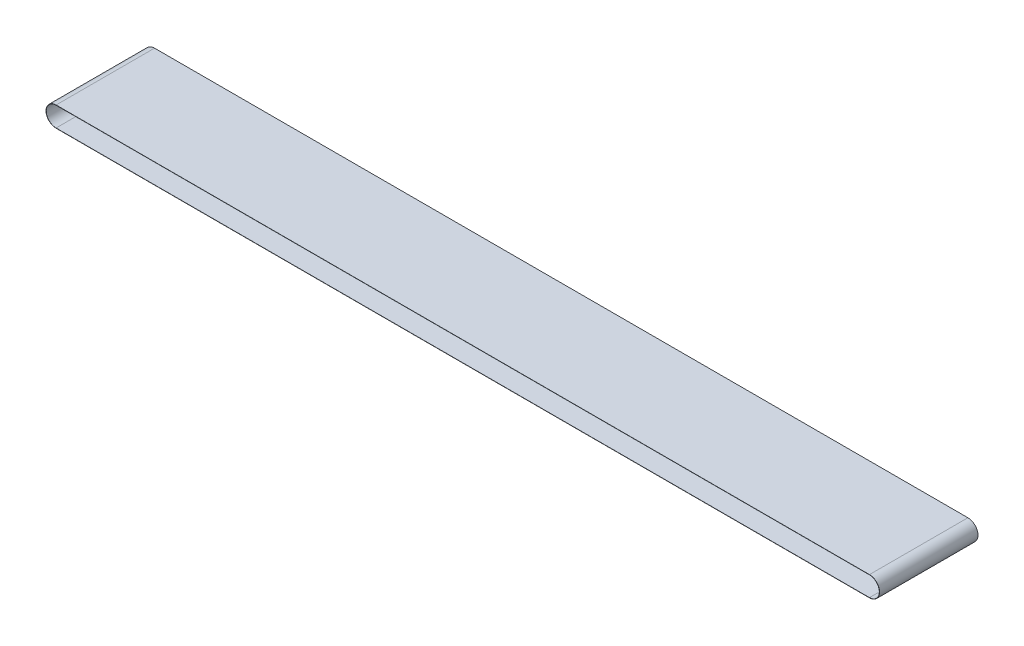
ISO-10303-21;
HEADER;
FILE_DESCRIPTION(('STEP AP214'),'2;1');
FILE_NAME('part.step','',(''),(''),'','','');
FILE_SCHEMA(('AUTOMOTIVE_DESIGN { 1 0 10303 214 1 1 1 1 }'));
ENDSEC;
DATA;
#1=APPLICATION_CONTEXT('core data for automotive mechanical design processes');
#2=APPLICATION_PROTOCOL_DEFINITION('international standard','automotive_design',2000,#1);
#3=PRODUCT_CONTEXT('',#1,'mechanical');
#4=PRODUCT('Part','Part','',(#3));
#5=PRODUCT_RELATED_PRODUCT_CATEGORY('part','',(#4));
#6=PRODUCT_DEFINITION_FORMATION('','',#4);
#7=PRODUCT_DEFINITION_CONTEXT('part definition',#1,'design');
#8=PRODUCT_DEFINITION('design','',#6,#7);
#9=PRODUCT_DEFINITION_SHAPE('','',#8);
#10=(LENGTH_UNIT() NAMED_UNIT(*) SI_UNIT(.MILLI.,.METRE.));
#11=(NAMED_UNIT(*) PLANE_ANGLE_UNIT() SI_UNIT($,.RADIAN.));
#12=(NAMED_UNIT(*) SI_UNIT($,.STERADIAN.) SOLID_ANGLE_UNIT());
#13=UNCERTAINTY_MEASURE_WITH_UNIT(LENGTH_MEASURE(1.E-05),#10,'distance_accuracy_value','');
#14=(GEOMETRIC_REPRESENTATION_CONTEXT(3) GLOBAL_UNCERTAINTY_ASSIGNED_CONTEXT((#13)) GLOBAL_UNIT_ASSIGNED_CONTEXT((#10,
#11,#12)) REPRESENTATION_CONTEXT('',''));
#15=CARTESIAN_POINT('',(0.,0.,0.));
#16=DIRECTION('',(0.,0.,1.));
#17=DIRECTION('',(1.,0.,0.));
#18=AXIS2_PLACEMENT_3D('',#15,#16,#17);
#19=CARTESIAN_POINT('',(0.,0.,250.));
#20=DIRECTION('',(0.,0.,1.));
#21=DIRECTION('',(1.,0.,0.));
#22=AXIS2_PLACEMENT_3D('',#19,#20,#21);
#23=PLANE('',#22);
#24=CARTESIAN_POINT('',(0.,0.,250.));
#25=DIRECTION('',(0.,0.,1.));
#26=DIRECTION('',(1.,0.,0.));
#27=AXIS2_PLACEMENT_3D('',#24,#25,#26);
#28=CIRCLE('',#27,51.2);
#29=CARTESIAN_POINT('',(0.,51.2,250.));
#30=VERTEX_POINT('',#29);
#31=CARTESIAN_POINT('',(0.,-51.2,250.));
#32=VERTEX_POINT('',#31);
#33=EDGE_CURVE('E134',#30,#32,#28,.T.);
#34=ORIENTED_EDGE('',*,*,#33,.T.);
#35=DIRECTION('',(1.,0.,0.));
#36=VECTOR('',#35,1.);
#37=CARTESIAN_POINT('',(0.,-51.2,250.));
#38=LINE('',#37,#36);
#39=CARTESIAN_POINT('',(4130.96,-51.2,250.));
#40=VERTEX_POINT('',#39);
#41=EDGE_CURVE('E137',#32,#40,#38,.T.);
#42=ORIENTED_EDGE('',*,*,#41,.T.);
#43=CARTESIAN_POINT('',(4130.96,0.,250.));
#44=DIRECTION('',(0.,0.,1.));
#45=DIRECTION('',(1.,0.,0.));
#46=AXIS2_PLACEMENT_3D('',#43,#44,#45);
#47=CIRCLE('',#46,51.2);
#48=CARTESIAN_POINT('',(4130.96,51.2,250.));
#49=VERTEX_POINT('',#48);
#50=EDGE_CURVE('E140',#40,#49,#47,.T.);
#51=ORIENTED_EDGE('',*,*,#50,.T.);
#52=DIRECTION('',(-1.,0.,0.));
#53=VECTOR('',#52,1.);
#54=CARTESIAN_POINT('',(0.,51.2,250.));
#55=LINE('',#54,#53);
#56=EDGE_CURVE('E142',#49,#30,#55,.T.);
#57=ORIENTED_EDGE('',*,*,#56,.T.);
#58=EDGE_LOOP('',(#34,#42,#51,#57));
#59=FACE_BOUND('',#58,.T.);
#60=DIRECTION('',(1.,0.,0.));
#61=VECTOR('',#60,1.);
#62=CARTESIAN_POINT('',(0.,-50.,250.));
#63=LINE('',#62,#61);
#64=CARTESIAN_POINT('',(0.,-50.,250.));
#65=VERTEX_POINT('',#64);
#66=CARTESIAN_POINT('',(4130.96,-50.,250.));
#67=VERTEX_POINT('',#66);
#68=EDGE_CURVE('E106',#65,#67,#63,.T.);
#69=ORIENTED_EDGE('',*,*,#68,.F.);
#70=CARTESIAN_POINT('',(0.,0.,250.));
#71=DIRECTION('',(0.,0.,1.));
#72=DIRECTION('',(1.,0.,0.));
#73=AXIS2_PLACEMENT_3D('',#70,#71,#72);
#74=CIRCLE('',#73,50.);
#75=CARTESIAN_POINT('',(0.,50.,250.));
#76=VERTEX_POINT('',#75);
#77=EDGE_CURVE('E98',#76,#65,#74,.T.);
#78=ORIENTED_EDGE('',*,*,#77,.F.);
#79=DIRECTION('',(-1.,0.,0.));
#80=VECTOR('',#79,1.);
#81=CARTESIAN_POINT('',(0.,50.,250.));
#82=LINE('',#81,#80);
#83=CARTESIAN_POINT('',(4130.96,50.,250.));
#84=VERTEX_POINT('',#83);
#85=EDGE_CURVE('E120',#84,#76,#82,.T.);
#86=ORIENTED_EDGE('',*,*,#85,.F.);
#87=CARTESIAN_POINT('',(4130.96,0.,250.));
#88=DIRECTION('',(0.,0.,1.));
#89=DIRECTION('',(1.,0.,0.));
#90=AXIS2_PLACEMENT_3D('',#87,#88,#89);
#91=CIRCLE('',#90,50.);
#92=EDGE_CURVE('E118',#67,#84,#91,.T.);
#93=ORIENTED_EDGE('',*,*,#92,.F.);
#94=EDGE_LOOP('',(#69,#78,#86,#93));
#95=FACE_BOUND('',#94,.T.);
#96=ADVANCED_FACE('F33',(#59,#95),#23,.T.);
#97=CARTESIAN_POINT('',(0.,0.,-250.));
#98=DIRECTION('',(0.,0.,1.));
#99=DIRECTION('',(1.,0.,0.));
#100=AXIS2_PLACEMENT_3D('',#97,#98,#99);
#101=PLANE('',#100);
#102=CARTESIAN_POINT('',(0.,0.,-250.));
#103=DIRECTION('',(0.,0.,1.));
#104=DIRECTION('',(1.,0.,0.));
#105=AXIS2_PLACEMENT_3D('',#102,#103,#104);
#106=CIRCLE('',#105,51.2);
#107=CARTESIAN_POINT('',(0.,51.2,-250.));
#108=VERTEX_POINT('',#107);
#109=CARTESIAN_POINT('',(0.,-51.2,-250.));
#110=VERTEX_POINT('',#109);
#111=EDGE_CURVE('E114',#108,#110,#106,.T.);
#112=ORIENTED_EDGE('',*,*,#111,.F.);
#113=DIRECTION('',(-1.,0.,0.));
#114=VECTOR('',#113,1.);
#115=CARTESIAN_POINT('',(0.,51.2,-250.));
#116=LINE('',#115,#114);
#117=CARTESIAN_POINT('',(4130.96,51.2,-250.));
#118=VERTEX_POINT('',#117);
#119=EDGE_CURVE('E138',#118,#108,#116,.T.);
#120=ORIENTED_EDGE('',*,*,#119,.F.);
#121=CARTESIAN_POINT('',(4130.96,0.,-250.));
#122=DIRECTION('',(0.,0.,1.));
#123=DIRECTION('',(1.,0.,0.));
#124=AXIS2_PLACEMENT_3D('',#121,#122,#123);
#125=CIRCLE('',#124,51.2);
#126=CARTESIAN_POINT('',(4130.96,-51.2,-250.));
#127=VERTEX_POINT('',#126);
#128=EDGE_CURVE('E149',#127,#118,#125,.T.);
#129=ORIENTED_EDGE('',*,*,#128,.F.);
#130=DIRECTION('',(1.,0.,0.));
#131=VECTOR('',#130,1.);
#132=CARTESIAN_POINT('',(0.,-51.2,-250.));
#133=LINE('',#132,#131);
#134=EDGE_CURVE('E147',#110,#127,#133,.T.);
#135=ORIENTED_EDGE('',*,*,#134,.F.);
#136=EDGE_LOOP('',(#112,#120,#129,#135));
#137=FACE_BOUND('',#136,.T.);
#138=CARTESIAN_POINT('',(0.,0.,-250.));
#139=DIRECTION('',(0.,0.,1.));
#140=DIRECTION('',(1.,0.,0.));
#141=AXIS2_PLACEMENT_3D('',#138,#139,#140);
#142=CIRCLE('',#141,50.);
#143=CARTESIAN_POINT('',(0.,50.,-250.));
#144=VERTEX_POINT('',#143);
#145=CARTESIAN_POINT('',(0.,-50.,-250.));
#146=VERTEX_POINT('',#145);
#147=EDGE_CURVE('E56',#144,#146,#142,.T.);
#148=ORIENTED_EDGE('',*,*,#147,.T.);
#149=DIRECTION('',(1.,0.,0.));
#150=VECTOR('',#149,1.);
#151=CARTESIAN_POINT('',(0.,-50.,-250.));
#152=LINE('',#151,#150);
#153=CARTESIAN_POINT('',(4130.96,-50.,-250.));
#154=VERTEX_POINT('',#153);
#155=EDGE_CURVE('E113',#146,#154,#152,.T.);
#156=ORIENTED_EDGE('',*,*,#155,.T.);
#157=CARTESIAN_POINT('',(4130.96,0.,-250.));
#158=DIRECTION('',(0.,0.,1.));
#159=DIRECTION('',(1.,0.,0.));
#160=AXIS2_PLACEMENT_3D('',#157,#158,#159);
#161=CIRCLE('',#160,50.);
#162=CARTESIAN_POINT('',(4130.96,50.,-250.));
#163=VERTEX_POINT('',#162);
#164=EDGE_CURVE('E126',#154,#163,#161,.T.);
#165=ORIENTED_EDGE('',*,*,#164,.T.);
#166=DIRECTION('',(-1.,0.,0.));
#167=VECTOR('',#166,1.);
#168=CARTESIAN_POINT('',(0.,50.,-250.));
#169=LINE('',#168,#167);
#170=EDGE_CURVE('E107',#163,#144,#169,.T.);
#171=ORIENTED_EDGE('',*,*,#170,.T.);
#172=EDGE_LOOP('',(#148,#156,#165,#171));
#173=FACE_BOUND('',#172,.T.);
#174=ADVANCED_FACE('F167',(#137,#173),#101,.F.);
#175=CARTESIAN_POINT('',(0.,0.,250.));
#176=DIRECTION('',(0.,0.,-1.));
#177=DIRECTION('',(-1.,0.,0.));
#178=AXIS2_PLACEMENT_3D('',#175,#176,#177);
#179=CYLINDRICAL_SURFACE('',#178,51.2);
#180=ORIENTED_EDGE('',*,*,#111,.T.);
#181=DIRECTION('',(0.,0.,-1.));
#182=VECTOR('',#181,1.);
#183=CARTESIAN_POINT('',(0.,-51.2,250.));
#184=LINE('',#183,#182);
#185=EDGE_CURVE('E11',#32,#110,#184,.T.);
#186=ORIENTED_EDGE('',*,*,#185,.F.);
#187=ORIENTED_EDGE('',*,*,#33,.F.);
#188=DIRECTION('',(0.,0.,-1.));
#189=VECTOR('',#188,1.);
#190=CARTESIAN_POINT('',(0.,51.2,250.));
#191=LINE('',#190,#189);
#192=EDGE_CURVE('E144',#30,#108,#191,.T.);
#193=ORIENTED_EDGE('',*,*,#192,.T.);
#194=EDGE_LOOP('',(#180,#186,#187,#193));
#195=FACE_BOUND('',#194,.T.);
#196=ADVANCED_FACE('F35',(#195),#179,.T.);
#197=CARTESIAN_POINT('',(0.,-51.2,250.));
#198=DIRECTION('',(0.,1.,0.));
#199=DIRECTION('',(0.,0.,1.));
#200=AXIS2_PLACEMENT_3D('',#197,#198,#199);
#201=PLANE('',#200);
#202=ORIENTED_EDGE('',*,*,#134,.T.);
#203=DIRECTION('',(0.,0.,-1.));
#204=VECTOR('',#203,1.);
#205=CARTESIAN_POINT('',(4130.96,-51.2,250.));
#206=LINE('',#205,#204);
#207=EDGE_CURVE('E41',#40,#127,#206,.T.);
#208=ORIENTED_EDGE('',*,*,#207,.F.);
#209=ORIENTED_EDGE('',*,*,#41,.F.);
#210=ORIENTED_EDGE('',*,*,#185,.T.);
#211=EDGE_LOOP('',(#202,#208,#209,#210));
#212=FACE_BOUND('',#211,.T.);
#213=ADVANCED_FACE('F177',(#212),#201,.F.);
#214=CARTESIAN_POINT('',(4130.96,0.,250.));
#215=DIRECTION('',(0.,0.,-1.));
#216=DIRECTION('',(-1.,0.,0.));
#217=AXIS2_PLACEMENT_3D('',#214,#215,#216);
#218=CYLINDRICAL_SURFACE('',#217,51.2);
#219=ORIENTED_EDGE('',*,*,#128,.T.);
#220=DIRECTION('',(0.,0.,-1.));
#221=VECTOR('',#220,1.);
#222=CARTESIAN_POINT('',(4130.96,51.2,250.));
#223=LINE('',#222,#221);
#224=EDGE_CURVE('E154',#49,#118,#223,.T.);
#225=ORIENTED_EDGE('',*,*,#224,.F.);
#226=ORIENTED_EDGE('',*,*,#50,.F.);
#227=ORIENTED_EDGE('',*,*,#207,.T.);
#228=EDGE_LOOP('',(#219,#225,#226,#227));
#229=FACE_BOUND('',#228,.T.);
#230=ADVANCED_FACE('F161',(#229),#218,.T.);
#231=CARTESIAN_POINT('',(0.,51.2,250.));
#232=DIRECTION('',(0.,-1.,0.));
#233=DIRECTION('',(0.,0.,-1.));
#234=AXIS2_PLACEMENT_3D('',#231,#232,#233);
#235=PLANE('',#234);
#236=ORIENTED_EDGE('',*,*,#119,.T.);
#237=ORIENTED_EDGE('',*,*,#192,.F.);
#238=ORIENTED_EDGE('',*,*,#56,.F.);
#239=ORIENTED_EDGE('',*,*,#224,.T.);
#240=EDGE_LOOP('',(#236,#237,#238,#239));
#241=FACE_BOUND('',#240,.T.);
#242=ADVANCED_FACE('F171',(#241),#235,.F.);
#243=CARTESIAN_POINT('',(0.,0.,250.));
#244=DIRECTION('',(0.,0.,-1.));
#245=DIRECTION('',(-1.,0.,0.));
#246=AXIS2_PLACEMENT_3D('',#243,#244,#245);
#247=CYLINDRICAL_SURFACE('',#246,50.);
#248=ORIENTED_EDGE('',*,*,#147,.F.);
#249=DIRECTION('',(0.,0.,-1.));
#250=VECTOR('',#249,1.);
#251=CARTESIAN_POINT('',(0.,50.,250.));
#252=LINE('',#251,#250);
#253=EDGE_CURVE('E102',#76,#144,#252,.T.);
#254=ORIENTED_EDGE('',*,*,#253,.F.);
#255=ORIENTED_EDGE('',*,*,#77,.T.);
#256=DIRECTION('',(0.,0.,-1.));
#257=VECTOR('',#256,1.);
#258=CARTESIAN_POINT('',(0.,-50.,250.));
#259=LINE('',#258,#257);
#260=EDGE_CURVE('E101',#65,#146,#259,.T.);
#261=ORIENTED_EDGE('',*,*,#260,.T.);
#262=EDGE_LOOP('',(#248,#254,#255,#261));
#263=FACE_BOUND('',#262,.T.);
#264=ADVANCED_FACE('F100',(#263),#247,.F.);
#265=CARTESIAN_POINT('',(0.,-50.,250.));
#266=DIRECTION('',(0.,1.,0.));
#267=DIRECTION('',(0.,0.,1.));
#268=AXIS2_PLACEMENT_3D('',#265,#266,#267);
#269=PLANE('',#268);
#270=ORIENTED_EDGE('',*,*,#155,.F.);
#271=ORIENTED_EDGE('',*,*,#260,.F.);
#272=ORIENTED_EDGE('',*,*,#68,.T.);
#273=DIRECTION('',(0.,0.,-1.));
#274=VECTOR('',#273,1.);
#275=CARTESIAN_POINT('',(4130.96,-50.,250.));
#276=LINE('',#275,#274);
#277=EDGE_CURVE('E115',#67,#154,#276,.T.);
#278=ORIENTED_EDGE('',*,*,#277,.T.);
#279=EDGE_LOOP('',(#270,#271,#272,#278));
#280=FACE_BOUND('',#279,.T.);
#281=ADVANCED_FACE('F110',(#280),#269,.T.);
#282=CARTESIAN_POINT('',(4130.96,0.,250.));
#283=DIRECTION('',(0.,0.,-1.));
#284=DIRECTION('',(-1.,0.,0.));
#285=AXIS2_PLACEMENT_3D('',#282,#283,#284);
#286=CYLINDRICAL_SURFACE('',#285,50.);
#287=ORIENTED_EDGE('',*,*,#164,.F.);
#288=ORIENTED_EDGE('',*,*,#277,.F.);
#289=ORIENTED_EDGE('',*,*,#92,.T.);
#290=DIRECTION('',(0.,0.,-1.));
#291=VECTOR('',#290,1.);
#292=CARTESIAN_POINT('',(4130.96,50.,250.));
#293=LINE('',#292,#291);
#294=EDGE_CURVE('E48',#84,#163,#293,.T.);
#295=ORIENTED_EDGE('',*,*,#294,.T.);
#296=EDGE_LOOP('',(#287,#288,#289,#295));
#297=FACE_BOUND('',#296,.T.);
#298=ADVANCED_FACE('F200',(#297),#286,.F.);
#299=CARTESIAN_POINT('',(0.,50.,250.));
#300=DIRECTION('',(0.,-1.,0.));
#301=DIRECTION('',(0.,0.,-1.));
#302=AXIS2_PLACEMENT_3D('',#299,#300,#301);
#303=PLANE('',#302);
#304=ORIENTED_EDGE('',*,*,#170,.F.);
#305=ORIENTED_EDGE('',*,*,#294,.F.);
#306=ORIENTED_EDGE('',*,*,#85,.T.);
#307=ORIENTED_EDGE('',*,*,#253,.T.);
#308=EDGE_LOOP('',(#304,#305,#306,#307));
#309=FACE_BOUND('',#308,.T.);
#310=ADVANCED_FACE('F204',(#309),#303,.T.);
#311=CLOSED_SHELL('',(#96,#174,#196,#213,#230,#242,#264,#281,#298,#310));
#312=MANIFOLD_SOLID_BREP('B2',#311);
#313=ADVANCED_BREP_SHAPE_REPRESENTATION('',(#18,#312),#14);
#314=SHAPE_DEFINITION_REPRESENTATION(#9,#313);
ENDSEC;
END-ISO-10303-21;
